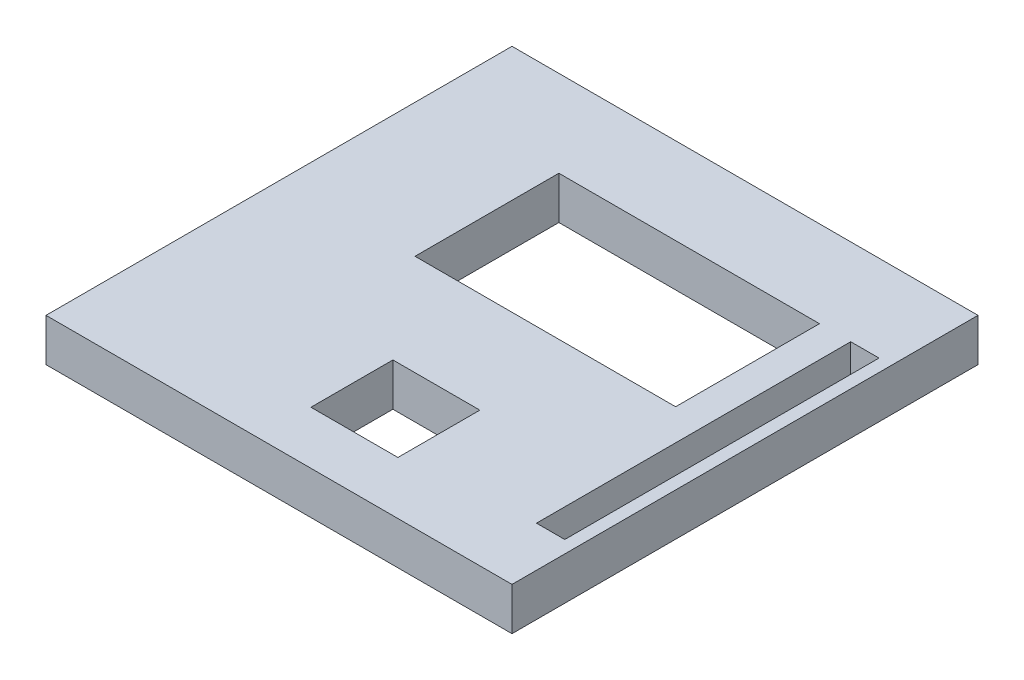
ISO-10303-21;
HEADER;
FILE_DESCRIPTION(('STEP AP214'),'2;1');
FILE_NAME('part.step','',(''),(''),'','','');
FILE_SCHEMA(('AUTOMOTIVE_DESIGN { 1 0 10303 214 1 1 1 1 }'));
ENDSEC;
DATA;
#1=APPLICATION_CONTEXT('core data for automotive mechanical design processes');
#2=APPLICATION_PROTOCOL_DEFINITION('international standard','automotive_design',2000,#1);
#3=PRODUCT_CONTEXT('',#1,'mechanical');
#4=PRODUCT('Part','Part','',(#3));
#5=PRODUCT_RELATED_PRODUCT_CATEGORY('part','',(#4));
#6=PRODUCT_DEFINITION_FORMATION('','',#4);
#7=PRODUCT_DEFINITION_CONTEXT('part definition',#1,'design');
#8=PRODUCT_DEFINITION('design','',#6,#7);
#9=PRODUCT_DEFINITION_SHAPE('','',#8);
#10=(LENGTH_UNIT() NAMED_UNIT(*) SI_UNIT(.MILLI.,.METRE.));
#11=(NAMED_UNIT(*) PLANE_ANGLE_UNIT() SI_UNIT($,.RADIAN.));
#12=(NAMED_UNIT(*) SI_UNIT($,.STERADIAN.) SOLID_ANGLE_UNIT());
#13=UNCERTAINTY_MEASURE_WITH_UNIT(LENGTH_MEASURE(1.E-05),#10,'distance_accuracy_value','');
#14=(GEOMETRIC_REPRESENTATION_CONTEXT(3) GLOBAL_UNCERTAINTY_ASSIGNED_CONTEXT((#13)) GLOBAL_UNIT_ASSIGNED_CONTEXT((#10,
#11,#12)) REPRESENTATION_CONTEXT('',''));
#15=CARTESIAN_POINT('',(0.,0.,0.));
#16=DIRECTION('',(0.,0.,1.));
#17=DIRECTION('',(1.,0.,0.));
#18=AXIS2_PLACEMENT_3D('',#15,#16,#17);
#19=CARTESIAN_POINT('',(-54.6107784431138,11.,-53.5329341317365));
#20=DIRECTION('',(1.,0.,0.));
#21=DIRECTION('',(0.,0.,-1.));
#22=AXIS2_PLACEMENT_3D('',#19,#20,#21);
#23=PLANE('',#22);
#24=DIRECTION('',(0.,0.,1.));
#25=VECTOR('',#24,1.);
#26=CARTESIAN_POINT('',(-54.6107784431138,0.,-53.5329341317365));
#27=LINE('',#26,#25);
#28=CARTESIAN_POINT('',(-54.6107784431138,0.,-53.5329341317365));
#29=VERTEX_POINT('',#28);
#30=CARTESIAN_POINT('',(-54.6107784431138,0.,66.4670658682635));
#31=VERTEX_POINT('',#30);
#32=EDGE_CURVE('E233',#29,#31,#27,.T.);
#33=ORIENTED_EDGE('',*,*,#32,.T.);
#34=DIRECTION('',(0.,-1.,0.));
#35=VECTOR('',#34,1.);
#36=CARTESIAN_POINT('',(-54.6107784431138,11.,66.4670658682635));
#37=LINE('',#36,#35);
#38=CARTESIAN_POINT('',(-54.6107784431138,11.,66.4670658682635));
#39=VERTEX_POINT('',#38);
#40=EDGE_CURVE('E280',#39,#31,#37,.T.);
#41=ORIENTED_EDGE('',*,*,#40,.F.);
#42=DIRECTION('',(0.,0.,1.));
#43=VECTOR('',#42,1.);
#44=CARTESIAN_POINT('',(-54.6107784431138,11.,-53.5329341317365));
#45=LINE('',#44,#43);
#46=CARTESIAN_POINT('',(-54.6107784431138,11.,-53.5329341317365));
#47=VERTEX_POINT('',#46);
#48=EDGE_CURVE('E243',#47,#39,#45,.T.);
#49=ORIENTED_EDGE('',*,*,#48,.F.);
#50=DIRECTION('',(0.,-1.,0.));
#51=VECTOR('',#50,1.);
#52=CARTESIAN_POINT('',(-54.6107784431138,11.,-53.5329341317365));
#53=LINE('',#52,#51);
#54=EDGE_CURVE('E257',#47,#29,#53,.T.);
#55=ORIENTED_EDGE('',*,*,#54,.T.);
#56=EDGE_LOOP('',(#33,#41,#49,#55));
#57=FACE_BOUND('',#56,.T.);
#58=ADVANCED_FACE('F43',(#57),#23,.F.);
#59=CARTESIAN_POINT('',(-54.6107784431138,11.,66.4670658682635));
#60=DIRECTION('',(0.,0.,-1.));
#61=DIRECTION('',(-1.,0.,0.));
#62=AXIS2_PLACEMENT_3D('',#59,#60,#61);
#63=PLANE('',#62);
#64=DIRECTION('',(1.,0.,0.));
#65=VECTOR('',#64,1.);
#66=CARTESIAN_POINT('',(-54.6107784431138,0.,66.4670658682635));
#67=LINE('',#66,#65);
#68=CARTESIAN_POINT('',(65.3892215568862,0.,66.4670658682635));
#69=VERTEX_POINT('',#68);
#70=EDGE_CURVE('E261',#31,#69,#67,.T.);
#71=ORIENTED_EDGE('',*,*,#70,.T.);
#72=DIRECTION('',(0.,-1.,0.));
#73=VECTOR('',#72,1.);
#74=CARTESIAN_POINT('',(65.3892215568862,11.,66.4670658682635));
#75=LINE('',#74,#73);
#76=CARTESIAN_POINT('',(65.3892215568862,11.,66.4670658682635));
#77=VERTEX_POINT('',#76);
#78=EDGE_CURVE('E276',#77,#69,#75,.T.);
#79=ORIENTED_EDGE('',*,*,#78,.F.);
#80=DIRECTION('',(1.,0.,0.));
#81=VECTOR('',#80,1.);
#82=CARTESIAN_POINT('',(-54.6107784431138,11.,66.4670658682635));
#83=LINE('',#82,#81);
#84=EDGE_CURVE('E247',#39,#77,#83,.T.);
#85=ORIENTED_EDGE('',*,*,#84,.F.);
#86=ORIENTED_EDGE('',*,*,#40,.T.);
#87=EDGE_LOOP('',(#71,#79,#85,#86));
#88=FACE_BOUND('',#87,.T.);
#89=ADVANCED_FACE('F353',(#88),#63,.F.);
#90=CARTESIAN_POINT('',(65.3892215568862,11.,-53.5329341317365));
#91=DIRECTION('',(-1.,0.,0.));
#92=DIRECTION('',(0.,0.,1.));
#93=AXIS2_PLACEMENT_3D('',#90,#91,#92);
#94=PLANE('',#93);
#95=DIRECTION('',(0.,0.,-1.));
#96=VECTOR('',#95,1.);
#97=CARTESIAN_POINT('',(65.3892215568862,0.,-53.5329341317365));
#98=LINE('',#97,#96);
#99=CARTESIAN_POINT('',(65.3892215568862,0.,-53.5329341317365));
#100=VERTEX_POINT('',#99);
#101=EDGE_CURVE('E264',#69,#100,#98,.T.);
#102=ORIENTED_EDGE('',*,*,#101,.T.);
#103=DIRECTION('',(0.,-1.,0.));
#104=VECTOR('',#103,1.);
#105=CARTESIAN_POINT('',(65.3892215568862,11.,-53.5329341317365));
#106=LINE('',#105,#104);
#107=CARTESIAN_POINT('',(65.3892215568862,11.,-53.5329341317365));
#108=VERTEX_POINT('',#107);
#109=EDGE_CURVE('E272',#108,#100,#106,.T.);
#110=ORIENTED_EDGE('',*,*,#109,.F.);
#111=DIRECTION('',(0.,0.,-1.));
#112=VECTOR('',#111,1.);
#113=CARTESIAN_POINT('',(65.3892215568862,11.,-53.5329341317365));
#114=LINE('',#113,#112);
#115=EDGE_CURVE('E251',#77,#108,#114,.T.);
#116=ORIENTED_EDGE('',*,*,#115,.F.);
#117=ORIENTED_EDGE('',*,*,#78,.T.);
#118=EDGE_LOOP('',(#102,#110,#116,#117));
#119=FACE_BOUND('',#118,.T.);
#120=ADVANCED_FACE('F358',(#119),#94,.F.);
#121=CARTESIAN_POINT('',(-54.6107784431138,11.,-53.5329341317365));
#122=DIRECTION('',(0.,0.,1.));
#123=DIRECTION('',(1.,0.,0.));
#124=AXIS2_PLACEMENT_3D('',#121,#122,#123);
#125=PLANE('',#124);
#126=DIRECTION('',(-1.,0.,0.));
#127=VECTOR('',#126,1.);
#128=CARTESIAN_POINT('',(-54.6107784431138,0.,-53.5329341317365));
#129=LINE('',#128,#127);
#130=EDGE_CURVE('E248',#100,#29,#129,.T.);
#131=ORIENTED_EDGE('',*,*,#130,.T.);
#132=ORIENTED_EDGE('',*,*,#54,.F.);
#133=DIRECTION('',(-1.,0.,0.));
#134=VECTOR('',#133,1.);
#135=CARTESIAN_POINT('',(-54.6107784431138,11.,-53.5329341317365));
#136=LINE('',#135,#134);
#137=EDGE_CURVE('E254',#108,#47,#136,.T.);
#138=ORIENTED_EDGE('',*,*,#137,.F.);
#139=ORIENTED_EDGE('',*,*,#109,.T.);
#140=EDGE_LOOP('',(#131,#132,#138,#139));
#141=FACE_BOUND('',#140,.T.);
#142=ADVANCED_FACE('F373',(#141),#125,.F.);
#143=CARTESIAN_POINT('',(0.,11.,0.));
#144=DIRECTION('',(0.,1.,0.));
#145=DIRECTION('',(0.,0.,1.));
#146=AXIS2_PLACEMENT_3D('',#143,#144,#145);
#147=PLANE('',#146);
#148=DIRECTION('',(0.,0.,1.));
#149=VECTOR('',#148,1.);
#150=CARTESIAN_POINT('',(54.8852243375605,11.,-31.2622491347966));
#151=LINE('',#150,#149);
#152=CARTESIAN_POINT('',(54.8852243375605,11.,-31.2622491347966));
#153=VERTEX_POINT('',#152);
#154=CARTESIAN_POINT('',(54.8852243375605,11.,49.662197129312));
#155=VERTEX_POINT('',#154);
#156=EDGE_CURVE('E58',#153,#155,#151,.T.);
#157=ORIENTED_EDGE('',*,*,#156,.F.);
#158=DIRECTION('',(-1.,0.,0.));
#159=VECTOR('',#158,1.);
#160=CARTESIAN_POINT('',(54.8852243375605,11.,-31.2622491347966));
#161=LINE('',#160,#159);
#162=CARTESIAN_POINT('',(62.1729793482119,11.,-31.2622491347966));
#163=VERTEX_POINT('',#162);
#164=EDGE_CURVE('E195',#163,#153,#161,.T.);
#165=ORIENTED_EDGE('',*,*,#164,.F.);
#166=DIRECTION('',(0.,0.,-1.));
#167=VECTOR('',#166,1.);
#168=CARTESIAN_POINT('',(62.1729793482119,11.,-31.2622491347966));
#169=LINE('',#168,#167);
#170=CARTESIAN_POINT('',(62.1729793482119,11.,49.662197129312));
#171=VERTEX_POINT('',#170);
#172=EDGE_CURVE('E208',#171,#163,#169,.T.);
#173=ORIENTED_EDGE('',*,*,#172,.F.);
#174=DIRECTION('',(1.,0.,0.));
#175=VECTOR('',#174,1.);
#176=CARTESIAN_POINT('',(54.8852243375605,11.,49.662197129312));
#177=LINE('',#176,#175);
#178=EDGE_CURVE('E212',#155,#171,#177,.T.);
#179=ORIENTED_EDGE('',*,*,#178,.F.);
#180=EDGE_LOOP('',(#157,#165,#173,#179));
#181=FACE_BOUND('',#180,.T.);
#182=DIRECTION('',(0.,0.,1.));
#183=VECTOR('',#182,1.);
#184=CARTESIAN_POINT('',(0.,11.,31.7464660614606));
#185=LINE('',#184,#183);
#186=CARTESIAN_POINT('',(0.,11.,31.7464660614606));
#187=VERTEX_POINT('',#186);
#188=CARTESIAN_POINT('',(0.,11.,52.850589946472));
#189=VERTEX_POINT('',#188);
#190=EDGE_CURVE('E66',#187,#189,#185,.T.);
#191=ORIENTED_EDGE('',*,*,#190,.F.);
#192=DIRECTION('',(-1.,0.,0.));
#193=VECTOR('',#192,1.);
#194=CARTESIAN_POINT('',(0.,11.,31.7464660614606));
#195=LINE('',#194,#193);
#196=CARTESIAN_POINT('',(22.3939832484062,11.,31.7464660614606));
#197=VERTEX_POINT('',#196);
#198=EDGE_CURVE('E167',#197,#187,#195,.T.);
#199=ORIENTED_EDGE('',*,*,#198,.F.);
#200=DIRECTION('',(0.,0.,-1.));
#201=VECTOR('',#200,1.);
#202=CARTESIAN_POINT('',(22.3939832484062,11.,31.7464660614606));
#203=LINE('',#202,#201);
#204=CARTESIAN_POINT('',(22.3939832484062,11.,52.850589946472));
#205=VERTEX_POINT('',#204);
#206=EDGE_CURVE('E174',#205,#197,#203,.T.);
#207=ORIENTED_EDGE('',*,*,#206,.F.);
#208=DIRECTION('',(1.,0.,0.));
#209=VECTOR('',#208,1.);
#210=CARTESIAN_POINT('',(0.,11.,52.850589946472));
#211=LINE('',#210,#209);
#212=EDGE_CURVE('E181',#189,#205,#211,.T.);
#213=ORIENTED_EDGE('',*,*,#212,.F.);
#214=EDGE_LOOP('',(#191,#199,#207,#213));
#215=FACE_BOUND('',#214,.T.);
#216=DIRECTION('',(0.,0.,1.));
#217=VECTOR('',#216,1.);
#218=CARTESIAN_POINT('',(-20.2697492097824,11.,-31.2622491347966));
#219=LINE('',#218,#217);
#220=CARTESIAN_POINT('',(-20.2697492097824,11.,-31.2622491347966));
#221=VERTEX_POINT('',#220);
#222=CARTESIAN_POINT('',(-20.2697492097824,11.,5.78383883601487));
#223=VERTEX_POINT('',#222);
#224=EDGE_CURVE('E183',#221,#223,#219,.T.);
#225=ORIENTED_EDGE('',*,*,#224,.F.);
#226=DIRECTION('',(-1.,0.,0.));
#227=VECTOR('',#226,1.);
#228=CARTESIAN_POINT('',(-20.2697492097824,11.,-31.2622491347966));
#229=LINE('',#228,#227);
#230=CARTESIAN_POINT('',(46.8383281799662,11.,-31.2622491347966));
#231=VERTEX_POINT('',#230);
#232=EDGE_CURVE('E225',#231,#221,#229,.T.);
#233=ORIENTED_EDGE('',*,*,#232,.F.);
#234=DIRECTION('',(0.,0.,-1.));
#235=VECTOR('',#234,1.);
#236=CARTESIAN_POINT('',(46.8383281799662,11.,-31.2622491347966));
#237=LINE('',#236,#235);
#238=CARTESIAN_POINT('',(46.8383281799662,11.,5.78383883601487));
#239=VERTEX_POINT('',#238);
#240=EDGE_CURVE('E221',#239,#231,#237,.T.);
#241=ORIENTED_EDGE('',*,*,#240,.F.);
#242=DIRECTION('',(1.,0.,0.));
#243=VECTOR('',#242,1.);
#244=CARTESIAN_POINT('',(-20.2697492097824,11.,5.78383883601487));
#245=LINE('',#244,#243);
#246=EDGE_CURVE('E187',#223,#239,#245,.T.);
#247=ORIENTED_EDGE('',*,*,#246,.F.);
#248=EDGE_LOOP('',(#225,#233,#241,#247));
#249=FACE_BOUND('',#248,.T.);
#250=ORIENTED_EDGE('',*,*,#48,.T.);
#251=ORIENTED_EDGE('',*,*,#84,.T.);
#252=ORIENTED_EDGE('',*,*,#115,.T.);
#253=ORIENTED_EDGE('',*,*,#137,.T.);
#254=EDGE_LOOP('',(#250,#251,#252,#253));
#255=FACE_BOUND('',#254,.T.);
#256=ADVANCED_FACE('F178',(#181,#215,#249,#255),#147,.T.);
#257=CARTESIAN_POINT('',(0.,0.,0.));
#258=DIRECTION('',(0.,1.,0.));
#259=DIRECTION('',(0.,0.,1.));
#260=AXIS2_PLACEMENT_3D('',#257,#258,#259);
#261=PLANE('',#260);
#262=DIRECTION('',(-1.,0.,0.));
#263=VECTOR('',#262,1.);
#264=CARTESIAN_POINT('',(0.,0.,-31.2622491347966));
#265=LINE('',#264,#263);
#266=CARTESIAN_POINT('',(62.1729793482119,0.,-31.2622491347966));
#267=VERTEX_POINT('',#266);
#268=CARTESIAN_POINT('',(54.8852243375605,0.,-31.2622491347966));
#269=VERTEX_POINT('',#268);
#270=EDGE_CURVE('E51',#267,#269,#265,.T.);
#271=ORIENTED_EDGE('',*,*,#270,.T.);
#272=DIRECTION('',(0.,0.,1.));
#273=VECTOR('',#272,1.);
#274=CARTESIAN_POINT('',(54.8852243375605,0.,0.));
#275=LINE('',#274,#273);
#276=CARTESIAN_POINT('',(54.8852243375605,0.,49.662197129312));
#277=VERTEX_POINT('',#276);
#278=EDGE_CURVE('E11',#269,#277,#275,.T.);
#279=ORIENTED_EDGE('',*,*,#278,.T.);
#280=DIRECTION('',(1.,0.,0.));
#281=VECTOR('',#280,1.);
#282=CARTESIAN_POINT('',(0.,0.,49.662197129312));
#283=LINE('',#282,#281);
#284=CARTESIAN_POINT('',(62.1729793482119,0.,49.662197129312));
#285=VERTEX_POINT('',#284);
#286=EDGE_CURVE('E313',#277,#285,#283,.T.);
#287=ORIENTED_EDGE('',*,*,#286,.T.);
#288=DIRECTION('',(0.,0.,-1.));
#289=VECTOR('',#288,1.);
#290=CARTESIAN_POINT('',(62.1729793482119,0.,0.));
#291=LINE('',#290,#289);
#292=EDGE_CURVE('E317',#285,#267,#291,.T.);
#293=ORIENTED_EDGE('',*,*,#292,.T.);
#294=EDGE_LOOP('',(#271,#279,#287,#293));
#295=FACE_BOUND('',#294,.T.);
#296=DIRECTION('',(-1.,0.,0.));
#297=VECTOR('',#296,1.);
#298=CARTESIAN_POINT('',(0.,0.,31.7464660614606));
#299=LINE('',#298,#297);
#300=CARTESIAN_POINT('',(22.3939832484062,0.,31.7464660614606));
#301=VERTEX_POINT('',#300);
#302=CARTESIAN_POINT('',(0.,0.,31.7464660614606));
#303=VERTEX_POINT('',#302);
#304=EDGE_CURVE('E308',#301,#303,#299,.T.);
#305=ORIENTED_EDGE('',*,*,#304,.T.);
#306=DIRECTION('',(0.,0.,1.));
#307=VECTOR('',#306,1.);
#308=CARTESIAN_POINT('',(0.,0.,0.));
#309=LINE('',#308,#307);
#310=CARTESIAN_POINT('',(0.,0.,52.850589946472));
#311=VERTEX_POINT('',#310);
#312=EDGE_CURVE('E160',#303,#311,#309,.T.);
#313=ORIENTED_EDGE('',*,*,#312,.T.);
#314=DIRECTION('',(1.,0.,0.));
#315=VECTOR('',#314,1.);
#316=CARTESIAN_POINT('',(0.,0.,52.850589946472));
#317=LINE('',#316,#315);
#318=CARTESIAN_POINT('',(22.3939832484062,0.,52.850589946472));
#319=VERTEX_POINT('',#318);
#320=EDGE_CURVE('E300',#311,#319,#317,.T.);
#321=ORIENTED_EDGE('',*,*,#320,.T.);
#322=DIRECTION('',(0.,0.,-1.));
#323=VECTOR('',#322,1.);
#324=CARTESIAN_POINT('',(22.3939832484062,0.,0.));
#325=LINE('',#324,#323);
#326=EDGE_CURVE('E304',#319,#301,#325,.T.);
#327=ORIENTED_EDGE('',*,*,#326,.T.);
#328=EDGE_LOOP('',(#305,#313,#321,#327));
#329=FACE_BOUND('',#328,.T.);
#330=DIRECTION('',(-1.,0.,0.));
#331=VECTOR('',#330,1.);
#332=CARTESIAN_POINT('',(0.,0.,-31.2622491347966));
#333=LINE('',#332,#331);
#334=CARTESIAN_POINT('',(46.8383281799662,0.,-31.2622491347966));
#335=VERTEX_POINT('',#334);
#336=CARTESIAN_POINT('',(-20.2697492097824,0.,-31.2622491347966));
#337=VERTEX_POINT('',#336);
#338=EDGE_CURVE('E292',#335,#337,#333,.T.);
#339=ORIENTED_EDGE('',*,*,#338,.T.);
#340=DIRECTION('',(0.,0.,1.));
#341=VECTOR('',#340,1.);
#342=CARTESIAN_POINT('',(-20.2697492097824,0.,0.));
#343=LINE('',#342,#341);
#344=CARTESIAN_POINT('',(-20.2697492097824,0.,5.78383883601487));
#345=VERTEX_POINT('',#344);
#346=EDGE_CURVE('E296',#337,#345,#343,.T.);
#347=ORIENTED_EDGE('',*,*,#346,.T.);
#348=DIRECTION('',(1.,0.,0.));
#349=VECTOR('',#348,1.);
#350=CARTESIAN_POINT('',(0.,0.,5.78383883601487));
#351=LINE('',#350,#349);
#352=CARTESIAN_POINT('',(46.8383281799662,0.,5.78383883601487));
#353=VERTEX_POINT('',#352);
#354=EDGE_CURVE('E284',#345,#353,#351,.T.);
#355=ORIENTED_EDGE('',*,*,#354,.T.);
#356=DIRECTION('',(0.,0.,-1.));
#357=VECTOR('',#356,1.);
#358=CARTESIAN_POINT('',(46.8383281799662,0.,0.));
#359=LINE('',#358,#357);
#360=EDGE_CURVE('E288',#353,#335,#359,.T.);
#361=ORIENTED_EDGE('',*,*,#360,.T.);
#362=EDGE_LOOP('',(#339,#347,#355,#361));
#363=FACE_BOUND('',#362,.T.);
#364=ORIENTED_EDGE('',*,*,#32,.F.);
#365=ORIENTED_EDGE('',*,*,#130,.F.);
#366=ORIENTED_EDGE('',*,*,#101,.F.);
#367=ORIENTED_EDGE('',*,*,#70,.F.);
#368=EDGE_LOOP('',(#364,#365,#366,#367));
#369=FACE_BOUND('',#368,.T.);
#370=ADVANCED_FACE('F323',(#295,#329,#363,#369),#261,.F.);
#371=CARTESIAN_POINT('',(-20.2697492097824,-22.,-31.2622491347966));
#372=DIRECTION('',(-1.,0.,0.));
#373=DIRECTION('',(0.,0.,1.));
#374=AXIS2_PLACEMENT_3D('',#371,#372,#373);
#375=PLANE('',#374);
#376=DIRECTION('',(0.,1.,0.));
#377=VECTOR('',#376,1.);
#378=CARTESIAN_POINT('',(-20.2697492097824,-22.,-31.2622491347966));
#379=LINE('',#378,#377);
#380=EDGE_CURVE('E230',#337,#221,#379,.T.);
#381=ORIENTED_EDGE('',*,*,#380,.T.);
#382=ORIENTED_EDGE('',*,*,#224,.T.);
#383=DIRECTION('',(0.,1.,0.));
#384=VECTOR('',#383,1.);
#385=CARTESIAN_POINT('',(-20.2697492097824,-22.,5.78383883601487));
#386=LINE('',#385,#384);
#387=EDGE_CURVE('E229',#345,#223,#386,.T.);
#388=ORIENTED_EDGE('',*,*,#387,.F.);
#389=ORIENTED_EDGE('',*,*,#346,.F.);
#390=EDGE_LOOP('',(#381,#382,#388,#389));
#391=FACE_BOUND('',#390,.T.);
#392=ADVANCED_FACE('F384',(#391),#375,.F.);
#393=CARTESIAN_POINT('',(-20.2697492097824,-22.,-31.2622491347966));
#394=DIRECTION('',(0.,0.,-1.));
#395=DIRECTION('',(-1.,0.,0.));
#396=AXIS2_PLACEMENT_3D('',#393,#394,#395);
#397=PLANE('',#396);
#398=DIRECTION('',(0.,1.,0.));
#399=VECTOR('',#398,1.);
#400=CARTESIAN_POINT('',(46.8383281799662,-22.,-31.2622491347966));
#401=LINE('',#400,#399);
#402=EDGE_CURVE('E234',#335,#231,#401,.T.);
#403=ORIENTED_EDGE('',*,*,#402,.T.);
#404=ORIENTED_EDGE('',*,*,#232,.T.);
#405=ORIENTED_EDGE('',*,*,#380,.F.);
#406=ORIENTED_EDGE('',*,*,#338,.F.);
#407=EDGE_LOOP('',(#403,#404,#405,#406));
#408=FACE_BOUND('',#407,.T.);
#409=ADVANCED_FACE('F389',(#408),#397,.F.);
#410=CARTESIAN_POINT('',(46.8383281799662,-22.,-31.2622491347966));
#411=DIRECTION('',(1.,0.,0.));
#412=DIRECTION('',(0.,0.,-1.));
#413=AXIS2_PLACEMENT_3D('',#410,#411,#412);
#414=PLANE('',#413);
#415=DIRECTION('',(0.,1.,0.));
#416=VECTOR('',#415,1.);
#417=CARTESIAN_POINT('',(46.8383281799662,-22.,5.78383883601487));
#418=LINE('',#417,#416);
#419=EDGE_CURVE('E237',#353,#239,#418,.T.);
#420=ORIENTED_EDGE('',*,*,#419,.T.);
#421=ORIENTED_EDGE('',*,*,#240,.T.);
#422=ORIENTED_EDGE('',*,*,#402,.F.);
#423=ORIENTED_EDGE('',*,*,#360,.F.);
#424=EDGE_LOOP('',(#420,#421,#422,#423));
#425=FACE_BOUND('',#424,.T.);
#426=ADVANCED_FACE('F394',(#425),#414,.F.);
#427=CARTESIAN_POINT('',(-20.2697492097824,-22.,5.78383883601487));
#428=DIRECTION('',(0.,0.,1.));
#429=DIRECTION('',(1.,0.,0.));
#430=AXIS2_PLACEMENT_3D('',#427,#428,#429);
#431=PLANE('',#430);
#432=ORIENTED_EDGE('',*,*,#387,.T.);
#433=ORIENTED_EDGE('',*,*,#246,.T.);
#434=ORIENTED_EDGE('',*,*,#419,.F.);
#435=ORIENTED_EDGE('',*,*,#354,.F.);
#436=EDGE_LOOP('',(#432,#433,#434,#435));
#437=FACE_BOUND('',#436,.T.);
#438=ADVANCED_FACE('F391',(#437),#431,.F.);
#439=CARTESIAN_POINT('',(0.,-22.,31.7464660614606));
#440=DIRECTION('',(-1.,0.,0.));
#441=DIRECTION('',(0.,0.,1.));
#442=AXIS2_PLACEMENT_3D('',#439,#440,#441);
#443=PLANE('',#442);
#444=DIRECTION('',(0.,1.,0.));
#445=VECTOR('',#444,1.);
#446=CARTESIAN_POINT('',(0.,-22.,31.7464660614606));
#447=LINE('',#446,#445);
#448=EDGE_CURVE('E156',#303,#187,#447,.T.);
#449=ORIENTED_EDGE('',*,*,#448,.T.);
#450=ORIENTED_EDGE('',*,*,#190,.T.);
#451=DIRECTION('',(0.,1.,0.));
#452=VECTOR('',#451,1.);
#453=CARTESIAN_POINT('',(0.,-22.,52.850589946472));
#454=LINE('',#453,#452);
#455=EDGE_CURVE('E175',#311,#189,#454,.T.);
#456=ORIENTED_EDGE('',*,*,#455,.F.);
#457=ORIENTED_EDGE('',*,*,#312,.F.);
#458=EDGE_LOOP('',(#449,#450,#456,#457));
#459=FACE_BOUND('',#458,.T.);
#460=ADVANCED_FACE('F158',(#459),#443,.F.);
#461=CARTESIAN_POINT('',(0.,-22.,31.7464660614606));
#462=DIRECTION('',(0.,0.,-1.));
#463=DIRECTION('',(-1.,0.,0.));
#464=AXIS2_PLACEMENT_3D('',#461,#462,#463);
#465=PLANE('',#464);
#466=DIRECTION('',(0.,1.,0.));
#467=VECTOR('',#466,1.);
#468=CARTESIAN_POINT('',(22.3939832484062,-22.,31.7464660614606));
#469=LINE('',#468,#467);
#470=EDGE_CURVE('E164',#301,#197,#469,.T.);
#471=ORIENTED_EDGE('',*,*,#470,.T.);
#472=ORIENTED_EDGE('',*,*,#198,.T.);
#473=ORIENTED_EDGE('',*,*,#448,.F.);
#474=ORIENTED_EDGE('',*,*,#304,.F.);
#475=EDGE_LOOP('',(#471,#472,#473,#474));
#476=FACE_BOUND('',#475,.T.);
#477=ADVANCED_FACE('F168',(#476),#465,.F.);
#478=CARTESIAN_POINT('',(22.3939832484062,-22.,31.7464660614606));
#479=DIRECTION('',(1.,0.,0.));
#480=DIRECTION('',(0.,0.,-1.));
#481=AXIS2_PLACEMENT_3D('',#478,#479,#480);
#482=PLANE('',#481);
#483=DIRECTION('',(0.,1.,0.));
#484=VECTOR('',#483,1.);
#485=CARTESIAN_POINT('',(22.3939832484062,-22.,52.850589946472));
#486=LINE('',#485,#484);
#487=EDGE_CURVE('E549',#319,#205,#486,.T.);
#488=ORIENTED_EDGE('',*,*,#487,.T.);
#489=ORIENTED_EDGE('',*,*,#206,.T.);
#490=ORIENTED_EDGE('',*,*,#470,.F.);
#491=ORIENTED_EDGE('',*,*,#326,.F.);
#492=EDGE_LOOP('',(#488,#489,#490,#491));
#493=FACE_BOUND('',#492,.T.);
#494=ADVANCED_FACE('F347',(#493),#482,.F.);
#495=CARTESIAN_POINT('',(0.,-22.,52.850589946472));
#496=DIRECTION('',(0.,0.,1.));
#497=DIRECTION('',(1.,0.,0.));
#498=AXIS2_PLACEMENT_3D('',#495,#496,#497);
#499=PLANE('',#498);
#500=ORIENTED_EDGE('',*,*,#455,.T.);
#501=ORIENTED_EDGE('',*,*,#212,.T.);
#502=ORIENTED_EDGE('',*,*,#487,.F.);
#503=ORIENTED_EDGE('',*,*,#320,.F.);
#504=EDGE_LOOP('',(#500,#501,#502,#503));
#505=FACE_BOUND('',#504,.T.);
#506=ADVANCED_FACE('F340',(#505),#499,.F.);
#507=CARTESIAN_POINT('',(54.8852243375605,-22.,-31.2622491347966));
#508=DIRECTION('',(-1.,0.,0.));
#509=DIRECTION('',(0.,0.,1.));
#510=AXIS2_PLACEMENT_3D('',#507,#508,#509);
#511=PLANE('',#510);
#512=DIRECTION('',(0.,1.,0.));
#513=VECTOR('',#512,1.);
#514=CARTESIAN_POINT('',(54.8852243375605,-22.,-31.2622491347966));
#515=LINE('',#514,#513);
#516=EDGE_CURVE('E202',#269,#153,#515,.T.);
#517=ORIENTED_EDGE('',*,*,#516,.T.);
#518=ORIENTED_EDGE('',*,*,#156,.T.);
#519=DIRECTION('',(0.,1.,0.));
#520=VECTOR('',#519,1.);
#521=CARTESIAN_POINT('',(54.8852243375605,-22.,49.662197129312));
#522=LINE('',#521,#520);
#523=EDGE_CURVE('E192',#277,#155,#522,.T.);
#524=ORIENTED_EDGE('',*,*,#523,.F.);
#525=ORIENTED_EDGE('',*,*,#278,.F.);
#526=EDGE_LOOP('',(#517,#518,#524,#525));
#527=FACE_BOUND('',#526,.T.);
#528=ADVANCED_FACE('F338',(#527),#511,.F.);
#529=CARTESIAN_POINT('',(54.8852243375605,-22.,-31.2622491347966));
#530=DIRECTION('',(0.,0.,-1.));
#531=DIRECTION('',(-1.,0.,0.));
#532=AXIS2_PLACEMENT_3D('',#529,#530,#531);
#533=PLANE('',#532);
#534=DIRECTION('',(0.,1.,0.));
#535=VECTOR('',#534,1.);
#536=CARTESIAN_POINT('',(62.1729793482119,-22.,-31.2622491347966));
#537=LINE('',#536,#535);
#538=EDGE_CURVE('E199',#267,#163,#537,.T.);
#539=ORIENTED_EDGE('',*,*,#538,.T.);
#540=ORIENTED_EDGE('',*,*,#164,.T.);
#541=ORIENTED_EDGE('',*,*,#516,.F.);
#542=ORIENTED_EDGE('',*,*,#270,.F.);
#543=EDGE_LOOP('',(#539,#540,#541,#542));
#544=FACE_BOUND('',#543,.T.);
#545=ADVANCED_FACE('F329',(#544),#533,.F.);
#546=CARTESIAN_POINT('',(62.1729793482119,-22.,-31.2622491347966));
#547=DIRECTION('',(1.,0.,0.));
#548=DIRECTION('',(0.,0.,-1.));
#549=AXIS2_PLACEMENT_3D('',#546,#547,#548);
#550=PLANE('',#549);
#551=DIRECTION('',(0.,1.,0.));
#552=VECTOR('',#551,1.);
#553=CARTESIAN_POINT('',(62.1729793482119,-22.,49.662197129312));
#554=LINE('',#553,#552);
#555=EDGE_CURVE('E196',#285,#171,#554,.T.);
#556=ORIENTED_EDGE('',*,*,#555,.T.);
#557=ORIENTED_EDGE('',*,*,#172,.T.);
#558=ORIENTED_EDGE('',*,*,#538,.F.);
#559=ORIENTED_EDGE('',*,*,#292,.F.);
#560=EDGE_LOOP('',(#556,#557,#558,#559));
#561=FACE_BOUND('',#560,.T.);
#562=ADVANCED_FACE('F331',(#561),#550,.F.);
#563=CARTESIAN_POINT('',(54.8852243375605,-22.,49.662197129312));
#564=DIRECTION('',(0.,0.,1.));
#565=DIRECTION('',(1.,0.,0.));
#566=AXIS2_PLACEMENT_3D('',#563,#564,#565);
#567=PLANE('',#566);
#568=ORIENTED_EDGE('',*,*,#523,.T.);
#569=ORIENTED_EDGE('',*,*,#178,.T.);
#570=ORIENTED_EDGE('',*,*,#555,.F.);
#571=ORIENTED_EDGE('',*,*,#286,.F.);
#572=EDGE_LOOP('',(#568,#569,#570,#571));
#573=FACE_BOUND('',#572,.T.);
#574=ADVANCED_FACE('F337',(#573),#567,.F.);
#575=CLOSED_SHELL('',(#58,#89,#120,#142,#256,#370,#392,#409,#426,#438,#460,#477,#494,#506,#528,
#545,#562,#574));
#576=MANIFOLD_SOLID_BREP('B2',#575);
#577=ADVANCED_BREP_SHAPE_REPRESENTATION('',(#18,#576),#14);
#578=SHAPE_DEFINITION_REPRESENTATION(#9,#577);
ENDSEC;
END-ISO-10303-21;
